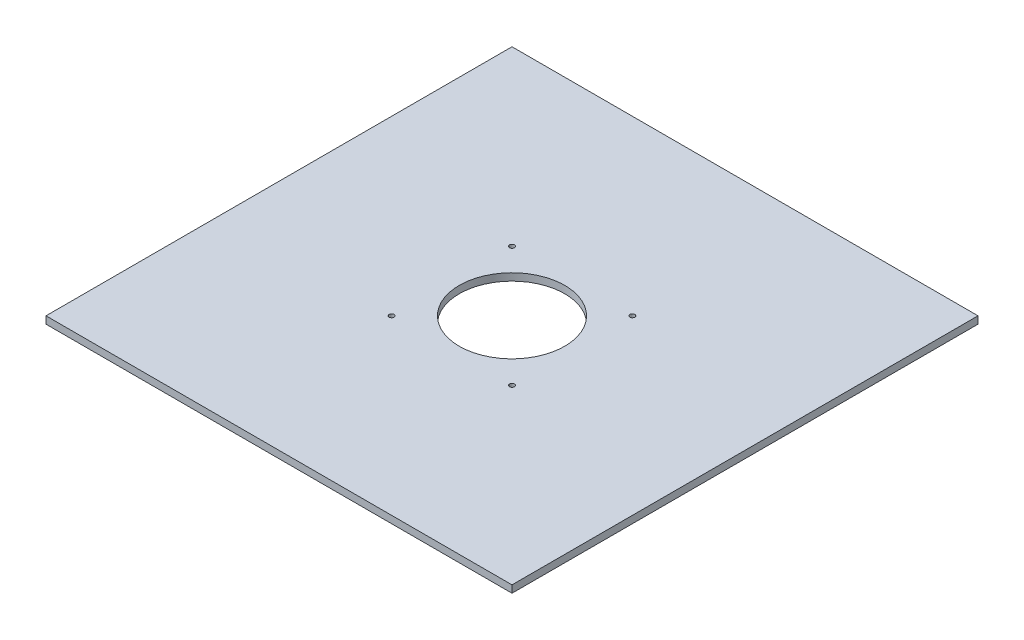
ISO-10303-21;
HEADER;
FILE_DESCRIPTION(('STEP AP214'),'2;1');
FILE_NAME('part.step','',(''),(''),'','','');
FILE_SCHEMA(('AUTOMOTIVE_DESIGN { 1 0 10303 214 1 1 1 1 }'));
ENDSEC;
DATA;
#1=APPLICATION_CONTEXT('core data for automotive mechanical design processes');
#2=APPLICATION_PROTOCOL_DEFINITION('international standard','automotive_design',2000,#1);
#3=PRODUCT_CONTEXT('',#1,'mechanical');
#4=PRODUCT('Part','Part','',(#3));
#5=PRODUCT_RELATED_PRODUCT_CATEGORY('part','',(#4));
#6=PRODUCT_DEFINITION_FORMATION('','',#4);
#7=PRODUCT_DEFINITION_CONTEXT('part definition',#1,'design');
#8=PRODUCT_DEFINITION('design','',#6,#7);
#9=PRODUCT_DEFINITION_SHAPE('','',#8);
#10=(LENGTH_UNIT() NAMED_UNIT(*) SI_UNIT(.MILLI.,.METRE.));
#11=(NAMED_UNIT(*) PLANE_ANGLE_UNIT() SI_UNIT($,.RADIAN.));
#12=(NAMED_UNIT(*) SI_UNIT($,.STERADIAN.) SOLID_ANGLE_UNIT());
#13=UNCERTAINTY_MEASURE_WITH_UNIT(LENGTH_MEASURE(1.E-05),#10,'distance_accuracy_value','');
#14=(GEOMETRIC_REPRESENTATION_CONTEXT(3) GLOBAL_UNCERTAINTY_ASSIGNED_CONTEXT((#13)) GLOBAL_UNIT_ASSIGNED_CONTEXT((#10,
#11,#12)) REPRESENTATION_CONTEXT('',''));
#15=CARTESIAN_POINT('',(0.,0.,0.));
#16=DIRECTION('',(0.,0.,1.));
#17=DIRECTION('',(1.,0.,0.));
#18=AXIS2_PLACEMENT_3D('',#15,#16,#17);
#19=CARTESIAN_POINT('',(-203.2,6.35,-203.2));
#20=DIRECTION('',(1.,0.,0.));
#21=DIRECTION('',(0.,0.,-1.));
#22=AXIS2_PLACEMENT_3D('',#19,#20,#21);
#23=PLANE('',#22);
#24=DIRECTION('',(0.,0.,1.));
#25=VECTOR('',#24,1.);
#26=CARTESIAN_POINT('',(-203.2,0.,-203.2));
#27=LINE('',#26,#25);
#28=CARTESIAN_POINT('',(-203.2,0.,-203.2));
#29=VERTEX_POINT('',#28);
#30=CARTESIAN_POINT('',(-203.2,0.,203.2));
#31=VERTEX_POINT('',#30);
#32=EDGE_CURVE('E96',#29,#31,#27,.T.);
#33=ORIENTED_EDGE('',*,*,#32,.T.);
#34=DIRECTION('',(0.,-1.,0.));
#35=VECTOR('',#34,1.);
#36=CARTESIAN_POINT('',(-203.2,6.35,203.2));
#37=LINE('',#36,#35);
#38=CARTESIAN_POINT('',(-203.2,6.35,203.2));
#39=VERTEX_POINT('',#38);
#40=EDGE_CURVE('E11',#39,#31,#37,.T.);
#41=ORIENTED_EDGE('',*,*,#40,.F.);
#42=DIRECTION('',(0.,0.,1.));
#43=VECTOR('',#42,1.);
#44=CARTESIAN_POINT('',(-203.2,6.35,-203.2));
#45=LINE('',#44,#43);
#46=CARTESIAN_POINT('',(-203.2,6.35,-203.2));
#47=VERTEX_POINT('',#46);
#48=EDGE_CURVE('E84',#47,#39,#45,.T.);
#49=ORIENTED_EDGE('',*,*,#48,.F.);
#50=DIRECTION('',(0.,-1.,0.));
#51=VECTOR('',#50,1.);
#52=CARTESIAN_POINT('',(-203.2,6.35,-203.2));
#53=LINE('',#52,#51);
#54=EDGE_CURVE('E92',#47,#29,#53,.T.);
#55=ORIENTED_EDGE('',*,*,#54,.T.);
#56=EDGE_LOOP('',(#33,#41,#49,#55));
#57=FACE_BOUND('',#56,.T.);
#58=ADVANCED_FACE('F33',(#57),#23,.F.);
#59=CARTESIAN_POINT('',(-203.2,6.35,203.2));
#60=DIRECTION('',(0.,0.,-1.));
#61=DIRECTION('',(-1.,0.,0.));
#62=AXIS2_PLACEMENT_3D('',#59,#60,#61);
#63=PLANE('',#62);
#64=DIRECTION('',(1.,0.,0.));
#65=VECTOR('',#64,1.);
#66=CARTESIAN_POINT('',(-203.2,0.,203.2));
#67=LINE('',#66,#65);
#68=CARTESIAN_POINT('',(203.2,0.,203.2));
#69=VERTEX_POINT('',#68);
#70=EDGE_CURVE('E88',#31,#69,#67,.T.);
#71=ORIENTED_EDGE('',*,*,#70,.T.);
#72=DIRECTION('',(0.,-1.,0.));
#73=VECTOR('',#72,1.);
#74=CARTESIAN_POINT('',(203.2,6.35,203.2));
#75=LINE('',#74,#73);
#76=CARTESIAN_POINT('',(203.2,6.35,203.2));
#77=VERTEX_POINT('',#76);
#78=EDGE_CURVE('E41',#77,#69,#75,.T.);
#79=ORIENTED_EDGE('',*,*,#78,.F.);
#80=DIRECTION('',(1.,0.,0.));
#81=VECTOR('',#80,1.);
#82=CARTESIAN_POINT('',(-203.2,6.35,203.2));
#83=LINE('',#82,#81);
#84=EDGE_CURVE('E79',#39,#77,#83,.T.);
#85=ORIENTED_EDGE('',*,*,#84,.F.);
#86=ORIENTED_EDGE('',*,*,#40,.T.);
#87=EDGE_LOOP('',(#71,#79,#85,#86));
#88=FACE_BOUND('',#87,.T.);
#89=ADVANCED_FACE('F87',(#88),#63,.F.);
#90=CARTESIAN_POINT('',(203.2,6.35,-203.2));
#91=DIRECTION('',(-1.,0.,0.));
#92=DIRECTION('',(0.,0.,1.));
#93=AXIS2_PLACEMENT_3D('',#90,#91,#92);
#94=PLANE('',#93);
#95=DIRECTION('',(0.,0.,-1.));
#96=VECTOR('',#95,1.);
#97=CARTESIAN_POINT('',(203.2,0.,-203.2));
#98=LINE('',#97,#96);
#99=CARTESIAN_POINT('',(203.2,0.,-203.2));
#100=VERTEX_POINT('',#99);
#101=EDGE_CURVE('E66',#69,#100,#98,.T.);
#102=ORIENTED_EDGE('',*,*,#101,.T.);
#103=DIRECTION('',(0.,-1.,0.));
#104=VECTOR('',#103,1.);
#105=CARTESIAN_POINT('',(203.2,6.35,-203.2));
#106=LINE('',#105,#104);
#107=CARTESIAN_POINT('',(203.2,6.35,-203.2));
#108=VERTEX_POINT('',#107);
#109=EDGE_CURVE('E89',#108,#100,#106,.T.);
#110=ORIENTED_EDGE('',*,*,#109,.F.);
#111=DIRECTION('',(0.,0.,-1.));
#112=VECTOR('',#111,1.);
#113=CARTESIAN_POINT('',(203.2,6.35,-203.2));
#114=LINE('',#113,#112);
#115=EDGE_CURVE('E82',#77,#108,#114,.T.);
#116=ORIENTED_EDGE('',*,*,#115,.F.);
#117=ORIENTED_EDGE('',*,*,#78,.T.);
#118=EDGE_LOOP('',(#102,#110,#116,#117));
#119=FACE_BOUND('',#118,.T.);
#120=ADVANCED_FACE('F90',(#119),#94,.F.);
#121=CARTESIAN_POINT('',(-203.2,6.35,-203.2));
#122=DIRECTION('',(0.,0.,1.));
#123=DIRECTION('',(1.,0.,0.));
#124=AXIS2_PLACEMENT_3D('',#121,#122,#123);
#125=PLANE('',#124);
#126=DIRECTION('',(-1.,0.,0.));
#127=VECTOR('',#126,1.);
#128=CARTESIAN_POINT('',(-203.2,0.,-203.2));
#129=LINE('',#128,#127);
#130=EDGE_CURVE('E72',#100,#29,#129,.T.);
#131=ORIENTED_EDGE('',*,*,#130,.T.);
#132=ORIENTED_EDGE('',*,*,#54,.F.);
#133=DIRECTION('',(-1.,0.,0.));
#134=VECTOR('',#133,1.);
#135=CARTESIAN_POINT('',(-203.2,6.35,-203.2));
#136=LINE('',#135,#134);
#137=EDGE_CURVE('E49',#108,#47,#136,.T.);
#138=ORIENTED_EDGE('',*,*,#137,.F.);
#139=ORIENTED_EDGE('',*,*,#109,.T.);
#140=EDGE_LOOP('',(#131,#132,#138,#139));
#141=FACE_BOUND('',#140,.T.);
#142=ADVANCED_FACE('F104',(#141),#125,.F.);
#143=CARTESIAN_POINT('',(0.,6.35,0.));
#144=DIRECTION('',(0.,1.,0.));
#145=DIRECTION('',(0.,0.,1.));
#146=AXIS2_PLACEMENT_3D('',#143,#144,#145);
#147=PLANE('',#146);
#148=CARTESIAN_POINT('',(52.5,6.35,-52.5));
#149=DIRECTION('',(0.,1.,0.));
#150=DIRECTION('',(0.,0.,1.));
#151=AXIS2_PLACEMENT_3D('',#148,#149,#150);
#152=CIRCLE('',#151,2.15);
#153=CARTESIAN_POINT('',(52.5,6.35,-50.35));
#154=VERTEX_POINT('',#153);
#155=EDGE_CURVE('E132',#154,#154,#152,.T.);
#156=ORIENTED_EDGE('',*,*,#155,.F.);
#157=EDGE_LOOP('',(#156));
#158=FACE_BOUND('',#157,.T.);
#159=CARTESIAN_POINT('',(52.5,6.35,52.5));
#160=DIRECTION('',(0.,1.,0.));
#161=DIRECTION('',(0.,0.,1.));
#162=AXIS2_PLACEMENT_3D('',#159,#160,#161);
#163=CIRCLE('',#162,2.15);
#164=CARTESIAN_POINT('',(52.5,6.35,54.65));
#165=VERTEX_POINT('',#164);
#166=EDGE_CURVE('E126',#165,#165,#163,.T.);
#167=ORIENTED_EDGE('',*,*,#166,.F.);
#168=EDGE_LOOP('',(#167));
#169=FACE_BOUND('',#168,.T.);
#170=CARTESIAN_POINT('',(-52.5,6.35,52.5));
#171=DIRECTION('',(0.,1.,0.));
#172=DIRECTION('',(0.,0.,1.));
#173=AXIS2_PLACEMENT_3D('',#170,#171,#172);
#174=CIRCLE('',#173,2.14999999999999);
#175=CARTESIAN_POINT('',(-52.5,6.35,54.65));
#176=VERTEX_POINT('',#175);
#177=EDGE_CURVE('E119',#176,#176,#174,.T.);
#178=ORIENTED_EDGE('',*,*,#177,.F.);
#179=EDGE_LOOP('',(#178));
#180=FACE_BOUND('',#179,.T.);
#181=CARTESIAN_POINT('',(-52.5,6.35,-52.5));
#182=DIRECTION('',(0.,1.,0.));
#183=DIRECTION('',(0.,0.,1.));
#184=AXIS2_PLACEMENT_3D('',#181,#182,#183);
#185=CIRCLE('',#184,2.165);
#186=CARTESIAN_POINT('',(-52.5,6.35,-50.335));
#187=VERTEX_POINT('',#186);
#188=EDGE_CURVE('E120',#187,#187,#185,.T.);
#189=ORIENTED_EDGE('',*,*,#188,.F.);
#190=EDGE_LOOP('',(#189));
#191=FACE_BOUND('',#190,.T.);
#192=CARTESIAN_POINT('',(0.,6.35,0.));
#193=DIRECTION('',(0.,1.,0.));
#194=DIRECTION('',(0.,0.,1.));
#195=AXIS2_PLACEMENT_3D('',#192,#193,#194);
#196=CIRCLE('',#195,46.);
#197=CARTESIAN_POINT('',(0.,6.35,46.));
#198=VERTEX_POINT('',#197);
#199=EDGE_CURVE('E112',#198,#198,#196,.T.);
#200=ORIENTED_EDGE('',*,*,#199,.F.);
#201=EDGE_LOOP('',(#200));
#202=FACE_BOUND('',#201,.T.);
#203=ORIENTED_EDGE('',*,*,#48,.T.);
#204=ORIENTED_EDGE('',*,*,#84,.T.);
#205=ORIENTED_EDGE('',*,*,#115,.T.);
#206=ORIENTED_EDGE('',*,*,#137,.T.);
#207=EDGE_LOOP('',(#203,#204,#205,#206));
#208=FACE_BOUND('',#207,.T.);
#209=ADVANCED_FACE('F80',(#158,#169,#180,#191,#202,#208),#147,.T.);
#210=CARTESIAN_POINT('',(0.,0.,0.));
#211=DIRECTION('',(0.,1.,0.));
#212=DIRECTION('',(0.,0.,1.));
#213=AXIS2_PLACEMENT_3D('',#210,#211,#212);
#214=PLANE('',#213);
#215=CARTESIAN_POINT('',(52.5,0.,-52.5));
#216=DIRECTION('',(0.,1.,0.));
#217=DIRECTION('',(0.,0.,1.));
#218=AXIS2_PLACEMENT_3D('',#215,#216,#217);
#219=CIRCLE('',#218,2.15);
#220=CARTESIAN_POINT('',(52.5,0.,-50.35));
#221=VERTEX_POINT('',#220);
#222=EDGE_CURVE('E115',#221,#221,#219,.F.);
#223=ORIENTED_EDGE('',*,*,#222,.F.);
#224=EDGE_LOOP('',(#223));
#225=FACE_BOUND('',#224,.T.);
#226=CARTESIAN_POINT('',(52.5,0.,52.5));
#227=DIRECTION('',(0.,1.,0.));
#228=DIRECTION('',(0.,0.,1.));
#229=AXIS2_PLACEMENT_3D('',#226,#227,#228);
#230=CIRCLE('',#229,2.15);
#231=CARTESIAN_POINT('',(52.5,0.,54.65));
#232=VERTEX_POINT('',#231);
#233=EDGE_CURVE('E129',#232,#232,#230,.F.);
#234=ORIENTED_EDGE('',*,*,#233,.F.);
#235=EDGE_LOOP('',(#234));
#236=FACE_BOUND('',#235,.T.);
#237=CARTESIAN_POINT('',(-52.5,0.,52.5));
#238=DIRECTION('',(0.,1.,0.));
#239=DIRECTION('',(0.,0.,1.));
#240=AXIS2_PLACEMENT_3D('',#237,#238,#239);
#241=CIRCLE('',#240,2.14999999999999);
#242=CARTESIAN_POINT('',(-52.5,0.,54.65));
#243=VERTEX_POINT('',#242);
#244=EDGE_CURVE('E123',#243,#243,#241,.F.);
#245=ORIENTED_EDGE('',*,*,#244,.F.);
#246=EDGE_LOOP('',(#245));
#247=FACE_BOUND('',#246,.T.);
#248=CARTESIAN_POINT('',(-52.5,0.,-52.5));
#249=DIRECTION('',(0.,1.,0.));
#250=DIRECTION('',(0.,0.,1.));
#251=AXIS2_PLACEMENT_3D('',#248,#249,#250);
#252=CIRCLE('',#251,2.165);
#253=CARTESIAN_POINT('',(-52.5,0.,-50.335));
#254=VERTEX_POINT('',#253);
#255=EDGE_CURVE('E116',#254,#254,#252,.F.);
#256=ORIENTED_EDGE('',*,*,#255,.F.);
#257=EDGE_LOOP('',(#256));
#258=FACE_BOUND('',#257,.T.);
#259=CARTESIAN_POINT('',(0.,0.,0.));
#260=DIRECTION('',(0.,1.,0.));
#261=DIRECTION('',(0.,0.,1.));
#262=AXIS2_PLACEMENT_3D('',#259,#260,#261);
#263=CIRCLE('',#262,46.);
#264=CARTESIAN_POINT('',(0.,0.,46.));
#265=VERTEX_POINT('',#264);
#266=EDGE_CURVE('E99',#265,#265,#263,.F.);
#267=ORIENTED_EDGE('',*,*,#266,.F.);
#268=EDGE_LOOP('',(#267));
#269=FACE_BOUND('',#268,.T.);
#270=ORIENTED_EDGE('',*,*,#32,.F.);
#271=ORIENTED_EDGE('',*,*,#130,.F.);
#272=ORIENTED_EDGE('',*,*,#101,.F.);
#273=ORIENTED_EDGE('',*,*,#70,.F.);
#274=EDGE_LOOP('',(#270,#271,#272,#273));
#275=FACE_BOUND('',#274,.T.);
#276=ADVANCED_FACE('F107',(#225,#236,#247,#258,#269,#275),#214,.F.);
#277=CARTESIAN_POINT('',(0.,-0.00100000000000013,0.));
#278=DIRECTION('',(0.,1.,0.));
#279=DIRECTION('',(0.,0.,1.));
#280=AXIS2_PLACEMENT_3D('',#277,#278,#279);
#281=CYLINDRICAL_SURFACE('',#280,46.);
#282=ORIENTED_EDGE('',*,*,#199,.T.);
#283=EDGE_LOOP('',(#282));
#284=FACE_BOUND('',#283,.T.);
#285=ORIENTED_EDGE('',*,*,#266,.T.);
#286=EDGE_LOOP('',(#285));
#287=FACE_BOUND('',#286,.T.);
#288=ADVANCED_FACE('F154',(#284,#287),#281,.F.);
#289=CARTESIAN_POINT('',(-52.5,-0.00100000000000013,-52.5));
#290=DIRECTION('',(0.,1.,0.));
#291=DIRECTION('',(0.,0.,1.));
#292=AXIS2_PLACEMENT_3D('',#289,#290,#291);
#293=CYLINDRICAL_SURFACE('',#292,2.165);
#294=ORIENTED_EDGE('',*,*,#188,.T.);
#295=EDGE_LOOP('',(#294));
#296=FACE_BOUND('',#295,.T.);
#297=ORIENTED_EDGE('',*,*,#255,.T.);
#298=EDGE_LOOP('',(#297));
#299=FACE_BOUND('',#298,.T.);
#300=ADVANCED_FACE('F157',(#296,#299),#293,.F.);
#301=CARTESIAN_POINT('',(-52.5,-0.00100000000000013,52.5));
#302=DIRECTION('',(0.,1.,0.));
#303=DIRECTION('',(0.,0.,1.));
#304=AXIS2_PLACEMENT_3D('',#301,#302,#303);
#305=CYLINDRICAL_SURFACE('',#304,2.14999999999999);
#306=ORIENTED_EDGE('',*,*,#177,.T.);
#307=EDGE_LOOP('',(#306));
#308=FACE_BOUND('',#307,.T.);
#309=ORIENTED_EDGE('',*,*,#244,.T.);
#310=EDGE_LOOP('',(#309));
#311=FACE_BOUND('',#310,.T.);
#312=ADVANCED_FACE('F205',(#308,#311),#305,.F.);
#313=CARTESIAN_POINT('',(52.5,-0.00100000000000013,52.5));
#314=DIRECTION('',(0.,1.,0.));
#315=DIRECTION('',(0.,0.,1.));
#316=AXIS2_PLACEMENT_3D('',#313,#314,#315);
#317=CYLINDRICAL_SURFACE('',#316,2.15);
#318=ORIENTED_EDGE('',*,*,#166,.T.);
#319=EDGE_LOOP('',(#318));
#320=FACE_BOUND('',#319,.T.);
#321=ORIENTED_EDGE('',*,*,#233,.T.);
#322=EDGE_LOOP('',(#321));
#323=FACE_BOUND('',#322,.T.);
#324=ADVANCED_FACE('F215',(#320,#323),#317,.F.);
#325=CARTESIAN_POINT('',(52.5,-0.00100000000000013,-52.5));
#326=DIRECTION('',(0.,1.,0.));
#327=DIRECTION('',(0.,0.,1.));
#328=AXIS2_PLACEMENT_3D('',#325,#326,#327);
#329=CYLINDRICAL_SURFACE('',#328,2.15);
#330=ORIENTED_EDGE('',*,*,#155,.T.);
#331=EDGE_LOOP('',(#330));
#332=FACE_BOUND('',#331,.T.);
#333=ORIENTED_EDGE('',*,*,#222,.T.);
#334=EDGE_LOOP('',(#333));
#335=FACE_BOUND('',#334,.T.);
#336=ADVANCED_FACE('F140',(#332,#335),#329,.F.);
#337=CLOSED_SHELL('',(#58,#89,#120,#142,#209,#276,#288,#300,#312,#324,#336));
#338=MANIFOLD_SOLID_BREP('B2',#337);
#339=ADVANCED_BREP_SHAPE_REPRESENTATION('',(#18,#338),#14);
#340=SHAPE_DEFINITION_REPRESENTATION(#9,#339);
ENDSEC;
END-ISO-10303-21;
